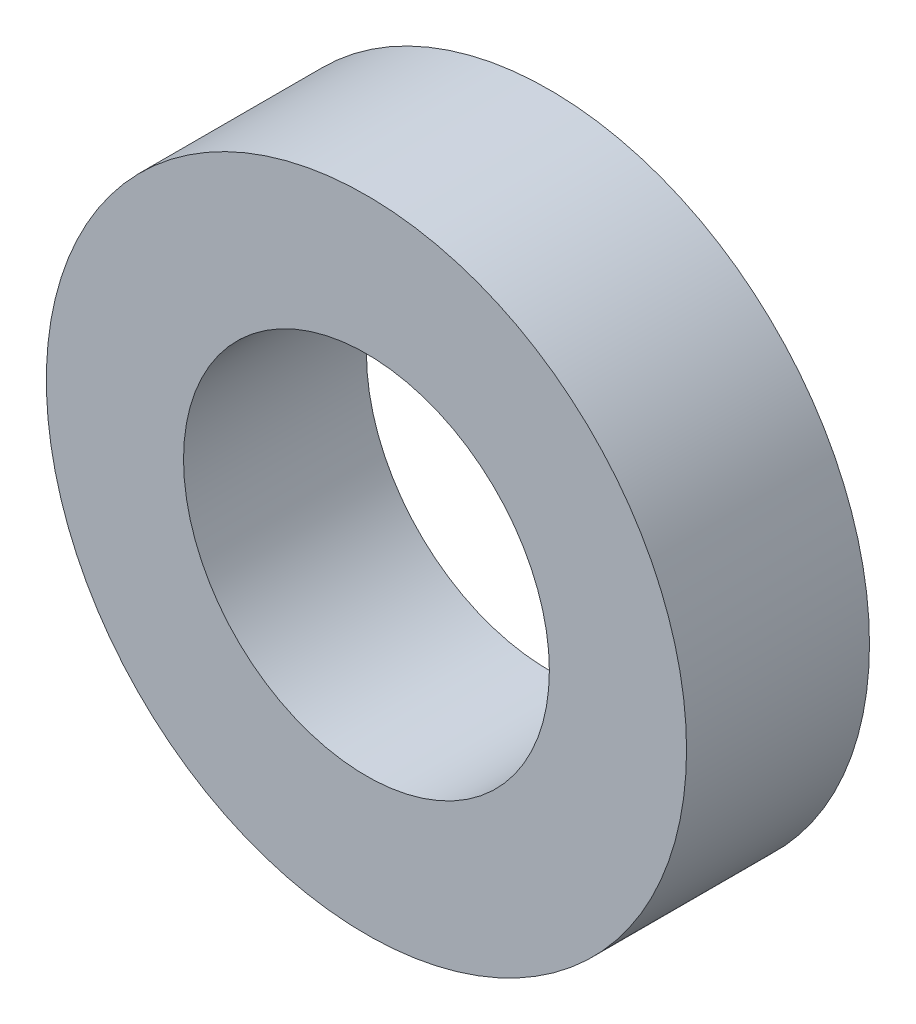
ISO-10303-21;
HEADER;
FILE_DESCRIPTION(('STEP AP214'),'2;1');
FILE_NAME('part.step','',(''),(''),'','','');
FILE_SCHEMA(('AUTOMOTIVE_DESIGN { 1 0 10303 214 1 1 1 1 }'));
ENDSEC;
DATA;
#1=APPLICATION_CONTEXT('core data for automotive mechanical design processes');
#2=APPLICATION_PROTOCOL_DEFINITION('international standard','automotive_design',2000,#1);
#3=PRODUCT_CONTEXT('',#1,'mechanical');
#4=PRODUCT('Part','Part','',(#3));
#5=PRODUCT_RELATED_PRODUCT_CATEGORY('part','',(#4));
#6=PRODUCT_DEFINITION_FORMATION('','',#4);
#7=PRODUCT_DEFINITION_CONTEXT('part definition',#1,'design');
#8=PRODUCT_DEFINITION('design','',#6,#7);
#9=PRODUCT_DEFINITION_SHAPE('','',#8);
#10=(LENGTH_UNIT() NAMED_UNIT(*) SI_UNIT(.MILLI.,.METRE.));
#11=(NAMED_UNIT(*) PLANE_ANGLE_UNIT() SI_UNIT($,.RADIAN.));
#12=(NAMED_UNIT(*) SI_UNIT($,.STERADIAN.) SOLID_ANGLE_UNIT());
#13=UNCERTAINTY_MEASURE_WITH_UNIT(LENGTH_MEASURE(1.E-05),#10,'distance_accuracy_value','');
#14=(GEOMETRIC_REPRESENTATION_CONTEXT(3) GLOBAL_UNCERTAINTY_ASSIGNED_CONTEXT((#13)) GLOBAL_UNIT_ASSIGNED_CONTEXT((#10,
#11,#12)) REPRESENTATION_CONTEXT('',''));
#15=CARTESIAN_POINT('',(0.,0.,0.));
#16=DIRECTION('',(0.,0.,1.));
#17=DIRECTION('',(1.,0.,0.));
#18=AXIS2_PLACEMENT_3D('',#15,#16,#17);
#19=CARTESIAN_POINT('',(0.,0.,2.));
#20=DIRECTION('',(0.,0.,1.));
#21=DIRECTION('',(1.,0.,0.));
#22=AXIS2_PLACEMENT_3D('',#19,#20,#21);
#23=PLANE('',#22);
#24=CARTESIAN_POINT('',(0.,0.,2.));
#25=DIRECTION('',(0.,0.,1.));
#26=DIRECTION('',(1.,0.,0.));
#27=AXIS2_PLACEMENT_3D('',#24,#25,#26);
#28=CIRCLE('',#27,7.);
#29=CARTESIAN_POINT('',(7.,0.,2.));
#30=VERTEX_POINT('',#29);
#31=EDGE_CURVE('E10',#30,#30,#28,.T.);
#32=ORIENTED_EDGE('',*,*,#31,.T.);
#33=EDGE_LOOP('',(#32));
#34=FACE_BOUND('',#33,.T.);
#35=CARTESIAN_POINT('',(0.,0.,2.));
#36=DIRECTION('',(0.,0.,1.));
#37=DIRECTION('',(1.,0.,0.));
#38=AXIS2_PLACEMENT_3D('',#35,#36,#37);
#39=CIRCLE('',#38,4.);
#40=CARTESIAN_POINT('',(4.,0.,2.));
#41=VERTEX_POINT('',#40);
#42=EDGE_CURVE('E41',#41,#41,#39,.T.);
#43=ORIENTED_EDGE('',*,*,#42,.F.);
#44=EDGE_LOOP('',(#43));
#45=FACE_BOUND('',#44,.T.);
#46=ADVANCED_FACE('F30',(#34,#45),#23,.T.);
#47=CARTESIAN_POINT('',(0.,0.,-2.));
#48=DIRECTION('',(0.,0.,1.));
#49=DIRECTION('',(1.,0.,0.));
#50=AXIS2_PLACEMENT_3D('',#47,#48,#49);
#51=PLANE('',#50);
#52=CARTESIAN_POINT('',(0.,0.,-2.));
#53=DIRECTION('',(0.,0.,1.));
#54=DIRECTION('',(1.,0.,0.));
#55=AXIS2_PLACEMENT_3D('',#52,#53,#54);
#56=CIRCLE('',#55,7.);
#57=CARTESIAN_POINT('',(7.,0.,-2.));
#58=VERTEX_POINT('',#57);
#59=EDGE_CURVE('E34',#58,#58,#56,.T.);
#60=ORIENTED_EDGE('',*,*,#59,.F.);
#61=EDGE_LOOP('',(#60));
#62=FACE_BOUND('',#61,.T.);
#63=CARTESIAN_POINT('',(0.,0.,-2.));
#64=DIRECTION('',(0.,0.,1.));
#65=DIRECTION('',(1.,0.,0.));
#66=AXIS2_PLACEMENT_3D('',#63,#64,#65);
#67=CIRCLE('',#66,4.);
#68=CARTESIAN_POINT('',(4.,0.,-2.));
#69=VERTEX_POINT('',#68);
#70=EDGE_CURVE('E43',#69,#69,#67,.T.);
#71=ORIENTED_EDGE('',*,*,#70,.T.);
#72=EDGE_LOOP('',(#71));
#73=FACE_BOUND('',#72,.T.);
#74=ADVANCED_FACE('F53',(#62,#73),#51,.F.);
#75=CARTESIAN_POINT('',(0.,0.,2.));
#76=DIRECTION('',(0.,0.,-1.));
#77=DIRECTION('',(-1.,0.,0.));
#78=AXIS2_PLACEMENT_3D('',#75,#76,#77);
#79=CYLINDRICAL_SURFACE('',#78,7.);
#80=ORIENTED_EDGE('',*,*,#31,.F.);
#81=EDGE_LOOP('',(#80));
#82=FACE_BOUND('',#81,.T.);
#83=ORIENTED_EDGE('',*,*,#59,.T.);
#84=EDGE_LOOP('',(#83));
#85=FACE_BOUND('',#84,.T.);
#86=ADVANCED_FACE('F32',(#82,#85),#79,.T.);
#87=CARTESIAN_POINT('',(0.,0.,2.));
#88=DIRECTION('',(0.,0.,-1.));
#89=DIRECTION('',(-1.,0.,0.));
#90=AXIS2_PLACEMENT_3D('',#87,#88,#89);
#91=CYLINDRICAL_SURFACE('',#90,4.);
#92=ORIENTED_EDGE('',*,*,#42,.T.);
#93=EDGE_LOOP('',(#92));
#94=FACE_BOUND('',#93,.T.);
#95=ORIENTED_EDGE('',*,*,#70,.F.);
#96=EDGE_LOOP('',(#95));
#97=FACE_BOUND('',#96,.T.);
#98=ADVANCED_FACE('F49',(#94,#97),#91,.F.);
#99=CLOSED_SHELL('',(#46,#74,#86,#98));
#100=MANIFOLD_SOLID_BREP('B2',#99);
#101=ADVANCED_BREP_SHAPE_REPRESENTATION('',(#18,#100),#14);
#102=SHAPE_DEFINITION_REPRESENTATION(#9,#101);
ENDSEC;
END-ISO-10303-21;
